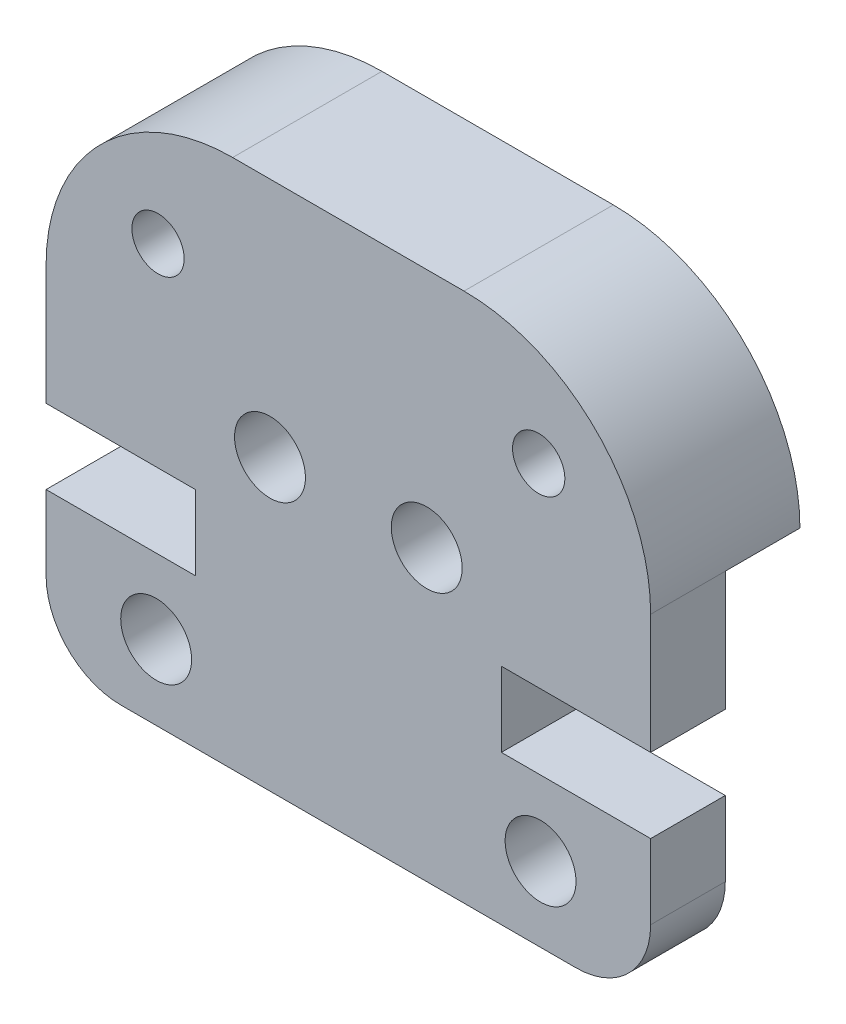
ISO-10303-21;
HEADER;
FILE_DESCRIPTION(('STEP AP214'),'2;1');
FILE_NAME('part.step','',(''),(''),'','','');
FILE_SCHEMA(('AUTOMOTIVE_DESIGN { 1 0 10303 214 1 1 1 1 }'));
ENDSEC;
DATA;
#1=APPLICATION_CONTEXT('core data for automotive mechanical design processes');
#2=APPLICATION_PROTOCOL_DEFINITION('international standard','automotive_design',2000,#1);
#3=PRODUCT_CONTEXT('',#1,'mechanical');
#4=PRODUCT('Part','Part','',(#3));
#5=PRODUCT_RELATED_PRODUCT_CATEGORY('part','',(#4));
#6=PRODUCT_DEFINITION_FORMATION('','',#4);
#7=PRODUCT_DEFINITION_CONTEXT('part definition',#1,'design');
#8=PRODUCT_DEFINITION('design','',#6,#7);
#9=PRODUCT_DEFINITION_SHAPE('','',#8);
#10=(LENGTH_UNIT() NAMED_UNIT(*) SI_UNIT(.MILLI.,.METRE.));
#11=(NAMED_UNIT(*) PLANE_ANGLE_UNIT() SI_UNIT($,.RADIAN.));
#12=(NAMED_UNIT(*) SI_UNIT($,.STERADIAN.) SOLID_ANGLE_UNIT());
#13=UNCERTAINTY_MEASURE_WITH_UNIT(LENGTH_MEASURE(1.E-05),#10,'distance_accuracy_value','');
#14=(GEOMETRIC_REPRESENTATION_CONTEXT(3) GLOBAL_UNCERTAINTY_ASSIGNED_CONTEXT((#13)) GLOBAL_UNIT_ASSIGNED_CONTEXT((#10,
#11,#12)) REPRESENTATION_CONTEXT('',''));
#15=CARTESIAN_POINT('',(0.,0.,0.));
#16=DIRECTION('',(0.,0.,1.));
#17=DIRECTION('',(1.,0.,0.));
#18=AXIS2_PLACEMENT_3D('',#15,#16,#17);
#19=CARTESIAN_POINT('',(14.2,2.00000000000002,4.));
#20=DIRECTION('',(0.,0.,-1.));
#21=DIRECTION('',(-1.,0.,0.));
#22=AXIS2_PLACEMENT_3D('',#19,#20,#21);
#23=CYLINDRICAL_SURFACE('',#22,2.00000000000001);
#24=CARTESIAN_POINT('',(14.2,2.00000000000002,2.));
#25=DIRECTION('',(0.,0.,-1.));
#26=DIRECTION('',(-1.,0.,0.));
#27=AXIS2_PLACEMENT_3D('',#24,#25,#26);
#28=CIRCLE('',#27,2.00000000000001);
#29=CARTESIAN_POINT('',(16.2,2.00000000000002,2.));
#30=VERTEX_POINT('',#29);
#31=CARTESIAN_POINT('',(14.2,0.,2.));
#32=VERTEX_POINT('',#31);
#33=EDGE_CURVE('E48',#30,#32,#28,.T.);
#34=ORIENTED_EDGE('',*,*,#33,.F.);
#35=DIRECTION('',(0.,0.,-1.));
#36=VECTOR('',#35,1.);
#37=CARTESIAN_POINT('',(16.2,2.00000000000002,4.));
#38=LINE('',#37,#36);
#39=CARTESIAN_POINT('',(16.2,2.00000000000002,4.));
#40=VERTEX_POINT('',#39);
#41=EDGE_CURVE('E11',#40,#30,#38,.T.);
#42=ORIENTED_EDGE('',*,*,#41,.F.);
#43=CARTESIAN_POINT('',(14.2,2.00000000000002,4.));
#44=DIRECTION('',(0.,0.,1.));
#45=DIRECTION('',(-1.,0.,0.));
#46=AXIS2_PLACEMENT_3D('',#43,#44,#45);
#47=CIRCLE('',#46,2.00000000000001);
#48=CARTESIAN_POINT('',(14.2,0.,4.));
#49=VERTEX_POINT('',#48);
#50=EDGE_CURVE('E159',#49,#40,#47,.T.);
#51=ORIENTED_EDGE('',*,*,#50,.F.);
#52=DIRECTION('',(0.,0.,-1.));
#53=VECTOR('',#52,1.);
#54=CARTESIAN_POINT('',(14.2,0.,4.));
#55=LINE('',#54,#53);
#56=EDGE_CURVE('E148',#49,#32,#55,.T.);
#57=ORIENTED_EDGE('',*,*,#56,.T.);
#58=EDGE_LOOP('',(#34,#42,#51,#57));
#59=FACE_BOUND('',#58,.T.);
#60=ADVANCED_FACE('F33',(#59),#23,.T.);
#61=CARTESIAN_POINT('',(16.2,2.00000000000002,4.));
#62=DIRECTION('',(-1.,0.,0.));
#63=DIRECTION('',(0.,0.,1.));
#64=AXIS2_PLACEMENT_3D('',#61,#62,#63);
#65=PLANE('',#64);
#66=DIRECTION('',(0.,-1.,0.));
#67=VECTOR('',#66,1.);
#68=CARTESIAN_POINT('',(16.2,9.205,2.));
#69=LINE('',#68,#67);
#70=CARTESIAN_POINT('',(16.2,4.00000000000002,2.));
#71=VERTEX_POINT('',#70);
#72=EDGE_CURVE('E207',#71,#30,#69,.T.);
#73=ORIENTED_EDGE('',*,*,#72,.F.);
#74=DIRECTION('',(0.,0.,-1.));
#75=VECTOR('',#74,1.);
#76=CARTESIAN_POINT('',(16.2,4.00000000000002,4.));
#77=LINE('',#76,#75);
#78=CARTESIAN_POINT('',(16.2,4.00000000000002,4.));
#79=VERTEX_POINT('',#78);
#80=EDGE_CURVE('E41',#79,#71,#77,.T.);
#81=ORIENTED_EDGE('',*,*,#80,.F.);
#82=DIRECTION('',(0.,1.,0.));
#83=VECTOR('',#82,1.);
#84=CARTESIAN_POINT('',(16.2,2.00000000000002,4.));
#85=LINE('',#84,#83);
#86=EDGE_CURVE('E81',#40,#79,#85,.T.);
#87=ORIENTED_EDGE('',*,*,#86,.F.);
#88=ORIENTED_EDGE('',*,*,#41,.T.);
#89=EDGE_LOOP('',(#73,#81,#87,#88));
#90=FACE_BOUND('',#89,.T.);
#91=ADVANCED_FACE('F206',(#90),#65,.F.);
#92=CARTESIAN_POINT('',(12.2,4.00000000000002,4.));
#93=DIRECTION('',(0.,-1.,0.));
#94=DIRECTION('',(1.,0.,0.));
#95=AXIS2_PLACEMENT_3D('',#92,#93,#94);
#96=PLANE('',#95);
#97=DIRECTION('',(1.,0.,0.));
#98=VECTOR('',#97,1.);
#99=CARTESIAN_POINT('',(12.2,4.00000000000002,2.));
#100=LINE('',#99,#98);
#101=CARTESIAN_POINT('',(12.2,4.00000000000002,2.));
#102=VERTEX_POINT('',#101);
#103=EDGE_CURVE('E200',#102,#71,#100,.T.);
#104=ORIENTED_EDGE('',*,*,#103,.F.);
#105=DIRECTION('',(0.,0.,-1.));
#106=VECTOR('',#105,1.);
#107=CARTESIAN_POINT('',(12.2,4.00000000000002,4.));
#108=LINE('',#107,#106);
#109=CARTESIAN_POINT('',(12.2,4.00000000000002,4.));
#110=VERTEX_POINT('',#109);
#111=EDGE_CURVE('E189',#110,#102,#108,.T.);
#112=ORIENTED_EDGE('',*,*,#111,.F.);
#113=DIRECTION('',(-1.,0.,0.));
#114=VECTOR('',#113,1.);
#115=CARTESIAN_POINT('',(12.2,4.00000000000002,4.));
#116=LINE('',#115,#114);
#117=EDGE_CURVE('E201',#79,#110,#116,.T.);
#118=ORIENTED_EDGE('',*,*,#117,.F.);
#119=ORIENTED_EDGE('',*,*,#80,.T.);
#120=EDGE_LOOP('',(#104,#112,#118,#119));
#121=FACE_BOUND('',#120,.T.);
#122=ADVANCED_FACE('F197',(#121),#96,.F.);
#123=CARTESIAN_POINT('',(12.2,6.00000000000003,4.));
#124=DIRECTION('',(-1.,0.,0.));
#125=DIRECTION('',(0.,-1.,0.));
#126=AXIS2_PLACEMENT_3D('',#123,#124,#125);
#127=PLANE('',#126);
#128=DIRECTION('',(0.,-1.,0.));
#129=VECTOR('',#128,1.);
#130=CARTESIAN_POINT('',(12.2,6.00000000000003,2.));
#131=LINE('',#130,#129);
#132=CARTESIAN_POINT('',(12.2,6.00000000000003,2.));
#133=VERTEX_POINT('',#132);
#134=EDGE_CURVE('E251',#133,#102,#131,.T.);
#135=ORIENTED_EDGE('',*,*,#134,.F.);
#136=DIRECTION('',(0.,0.,-1.));
#137=VECTOR('',#136,1.);
#138=CARTESIAN_POINT('',(12.2,6.00000000000003,4.));
#139=LINE('',#138,#137);
#140=CARTESIAN_POINT('',(12.2,6.00000000000003,4.));
#141=VERTEX_POINT('',#140);
#142=EDGE_CURVE('E186',#141,#133,#139,.T.);
#143=ORIENTED_EDGE('',*,*,#142,.F.);
#144=DIRECTION('',(0.,1.,0.));
#145=VECTOR('',#144,1.);
#146=CARTESIAN_POINT('',(12.2,6.00000000000003,4.));
#147=LINE('',#146,#145);
#148=EDGE_CURVE('E282',#110,#141,#147,.T.);
#149=ORIENTED_EDGE('',*,*,#148,.F.);
#150=ORIENTED_EDGE('',*,*,#111,.T.);
#151=EDGE_LOOP('',(#135,#143,#149,#150));
#152=FACE_BOUND('',#151,.T.);
#153=ADVANCED_FACE('F325',(#152),#127,.F.);
#154=CARTESIAN_POINT('',(16.2,6.00000000000003,4.));
#155=DIRECTION('',(0.,1.,0.));
#156=DIRECTION('',(-1.,0.,0.));
#157=AXIS2_PLACEMENT_3D('',#154,#155,#156);
#158=PLANE('',#157);
#159=DIRECTION('',(-1.,0.,0.));
#160=VECTOR('',#159,1.);
#161=CARTESIAN_POINT('',(16.2,6.00000000000003,2.));
#162=LINE('',#161,#160);
#163=CARTESIAN_POINT('',(16.2,6.00000000000003,2.));
#164=VERTEX_POINT('',#163);
#165=EDGE_CURVE('E248',#164,#133,#162,.T.);
#166=ORIENTED_EDGE('',*,*,#165,.F.);
#167=DIRECTION('',(0.,0.,-1.));
#168=VECTOR('',#167,1.);
#169=CARTESIAN_POINT('',(16.2,6.00000000000003,4.));
#170=LINE('',#169,#168);
#171=CARTESIAN_POINT('',(16.2,6.00000000000003,4.));
#172=VERTEX_POINT('',#171);
#173=EDGE_CURVE('E183',#172,#164,#170,.T.);
#174=ORIENTED_EDGE('',*,*,#173,.F.);
#175=DIRECTION('',(1.,0.,0.));
#176=VECTOR('',#175,1.);
#177=CARTESIAN_POINT('',(16.2,6.00000000000003,4.));
#178=LINE('',#177,#176);
#179=EDGE_CURVE('E284',#141,#172,#178,.T.);
#180=ORIENTED_EDGE('',*,*,#179,.F.);
#181=ORIENTED_EDGE('',*,*,#142,.T.);
#182=EDGE_LOOP('',(#166,#174,#180,#181));
#183=FACE_BOUND('',#182,.T.);
#184=ADVANCED_FACE('F329',(#183),#158,.F.);
#185=CARTESIAN_POINT('',(16.2,9.205,4.));
#186=DIRECTION('',(-1.,0.,0.));
#187=DIRECTION('',(0.,-1.,0.));
#188=AXIS2_PLACEMENT_3D('',#185,#186,#187);
#189=PLANE('',#188);
#190=CARTESIAN_POINT('',(16.2,9.205,2.));
#191=VERTEX_POINT('',#190);
#192=EDGE_CURVE('E209',#191,#164,#69,.T.);
#193=ORIENTED_EDGE('',*,*,#192,.F.);
#194=DIRECTION('',(0.,0.,-1.));
#195=VECTOR('',#194,1.);
#196=CARTESIAN_POINT('',(16.2,9.205,4.));
#197=LINE('',#196,#195);
#198=CARTESIAN_POINT('',(16.2,9.205,4.));
#199=VERTEX_POINT('',#198);
#200=EDGE_CURVE('E180',#199,#191,#197,.T.);
#201=ORIENTED_EDGE('',*,*,#200,.F.);
#202=DIRECTION('',(0.,1.,0.));
#203=VECTOR('',#202,1.);
#204=CARTESIAN_POINT('',(16.2,9.205,4.));
#205=LINE('',#204,#203);
#206=EDGE_CURVE('E286',#172,#199,#205,.T.);
#207=ORIENTED_EDGE('',*,*,#206,.F.);
#208=ORIENTED_EDGE('',*,*,#173,.T.);
#209=EDGE_LOOP('',(#193,#201,#207,#208));
#210=FACE_BOUND('',#209,.T.);
#211=ADVANCED_FACE('F376',(#210),#189,.F.);
#212=CARTESIAN_POINT('',(0.,9.20499999999999,4.));
#213=DIRECTION('',(1.,0.,0.));
#214=DIRECTION('',(0.,0.,-1.));
#215=AXIS2_PLACEMENT_3D('',#212,#213,#214);
#216=PLANE('',#215);
#217=DIRECTION('',(0.,1.,0.));
#218=VECTOR('',#217,1.);
#219=CARTESIAN_POINT('',(0.,0.,2.));
#220=LINE('',#219,#218);
#221=CARTESIAN_POINT('',(0.,6.00000000000003,2.));
#222=VERTEX_POINT('',#221);
#223=CARTESIAN_POINT('',(0.,9.20499999999999,2.));
#224=VERTEX_POINT('',#223);
#225=EDGE_CURVE('E349',#222,#224,#220,.T.);
#226=ORIENTED_EDGE('',*,*,#225,.F.);
#227=DIRECTION('',(0.,0.,-1.));
#228=VECTOR('',#227,1.);
#229=CARTESIAN_POINT('',(0.,6.00000000000003,4.));
#230=LINE('',#229,#228);
#231=CARTESIAN_POINT('',(0.,6.00000000000003,4.));
#232=VERTEX_POINT('',#231);
#233=EDGE_CURVE('E170',#232,#222,#230,.T.);
#234=ORIENTED_EDGE('',*,*,#233,.F.);
#235=DIRECTION('',(0.,-1.,0.));
#236=VECTOR('',#235,1.);
#237=CARTESIAN_POINT('',(0.,9.20499999999999,4.));
#238=LINE('',#237,#236);
#239=CARTESIAN_POINT('',(0.,9.20499999999999,4.));
#240=VERTEX_POINT('',#239);
#241=EDGE_CURVE('E294',#240,#232,#238,.T.);
#242=ORIENTED_EDGE('',*,*,#241,.F.);
#243=DIRECTION('',(0.,0.,-1.));
#244=VECTOR('',#243,1.);
#245=CARTESIAN_POINT('',(0.,9.20499999999999,4.));
#246=LINE('',#245,#244);
#247=EDGE_CURVE('E173',#240,#224,#246,.T.);
#248=ORIENTED_EDGE('',*,*,#247,.T.);
#249=EDGE_LOOP('',(#226,#234,#242,#248));
#250=FACE_BOUND('',#249,.T.);
#251=ADVANCED_FACE('F365',(#250),#216,.F.);
#252=CARTESIAN_POINT('',(0.,6.00000000000003,4.));
#253=DIRECTION('',(0.,1.,0.));
#254=DIRECTION('',(-1.,0.,0.));
#255=AXIS2_PLACEMENT_3D('',#252,#253,#254);
#256=PLANE('',#255);
#257=DIRECTION('',(-1.,0.,0.));
#258=VECTOR('',#257,1.);
#259=CARTESIAN_POINT('',(0.,6.00000000000003,2.));
#260=LINE('',#259,#258);
#261=CARTESIAN_POINT('',(4.00000000000001,6.00000000000003,2.));
#262=VERTEX_POINT('',#261);
#263=EDGE_CURVE('E245',#262,#222,#260,.T.);
#264=ORIENTED_EDGE('',*,*,#263,.F.);
#265=DIRECTION('',(0.,0.,-1.));
#266=VECTOR('',#265,1.);
#267=CARTESIAN_POINT('',(4.00000000000001,6.00000000000003,4.));
#268=LINE('',#267,#266);
#269=CARTESIAN_POINT('',(4.00000000000001,6.00000000000003,4.));
#270=VERTEX_POINT('',#269);
#271=EDGE_CURVE('E167',#270,#262,#268,.T.);
#272=ORIENTED_EDGE('',*,*,#271,.F.);
#273=DIRECTION('',(1.,0.,0.));
#274=VECTOR('',#273,1.);
#275=CARTESIAN_POINT('',(0.,6.00000000000003,4.));
#276=LINE('',#275,#274);
#277=EDGE_CURVE('E296',#232,#270,#276,.T.);
#278=ORIENTED_EDGE('',*,*,#277,.F.);
#279=ORIENTED_EDGE('',*,*,#233,.T.);
#280=EDGE_LOOP('',(#264,#272,#278,#279));
#281=FACE_BOUND('',#280,.T.);
#282=ADVANCED_FACE('F383',(#281),#256,.F.);
#283=CARTESIAN_POINT('',(4.00000000000001,6.00000000000003,4.));
#284=DIRECTION('',(1.,0.,0.));
#285=DIRECTION('',(0.,0.,-1.));
#286=AXIS2_PLACEMENT_3D('',#283,#284,#285);
#287=PLANE('',#286);
#288=DIRECTION('',(0.,1.,0.));
#289=VECTOR('',#288,1.);
#290=CARTESIAN_POINT('',(4.00000000000001,6.00000000000003,2.));
#291=LINE('',#290,#289);
#292=CARTESIAN_POINT('',(4.00000000000001,4.00000000000002,2.));
#293=VERTEX_POINT('',#292);
#294=EDGE_CURVE('E242',#293,#262,#291,.T.);
#295=ORIENTED_EDGE('',*,*,#294,.F.);
#296=DIRECTION('',(0.,0.,-1.));
#297=VECTOR('',#296,1.);
#298=CARTESIAN_POINT('',(4.00000000000001,4.00000000000002,4.));
#299=LINE('',#298,#297);
#300=CARTESIAN_POINT('',(4.00000000000001,4.00000000000002,4.));
#301=VERTEX_POINT('',#300);
#302=EDGE_CURVE('E164',#301,#293,#299,.T.);
#303=ORIENTED_EDGE('',*,*,#302,.F.);
#304=DIRECTION('',(0.,-1.,0.));
#305=VECTOR('',#304,1.);
#306=CARTESIAN_POINT('',(4.00000000000001,6.00000000000003,4.));
#307=LINE('',#306,#305);
#308=EDGE_CURVE('E298',#270,#301,#307,.T.);
#309=ORIENTED_EDGE('',*,*,#308,.F.);
#310=ORIENTED_EDGE('',*,*,#271,.T.);
#311=EDGE_LOOP('',(#295,#303,#309,#310));
#312=FACE_BOUND('',#311,.T.);
#313=ADVANCED_FACE('F305',(#312),#287,.F.);
#314=CARTESIAN_POINT('',(4.00000000000001,4.00000000000002,4.));
#315=DIRECTION('',(0.,-1.,0.));
#316=DIRECTION('',(1.,0.,0.));
#317=AXIS2_PLACEMENT_3D('',#314,#315,#316);
#318=PLANE('',#317);
#319=DIRECTION('',(1.,0.,0.));
#320=VECTOR('',#319,1.);
#321=CARTESIAN_POINT('',(4.00000000000001,4.00000000000002,2.));
#322=LINE('',#321,#320);
#323=CARTESIAN_POINT('',(0.,4.00000000000003,2.));
#324=VERTEX_POINT('',#323);
#325=EDGE_CURVE('E239',#324,#293,#322,.T.);
#326=ORIENTED_EDGE('',*,*,#325,.F.);
#327=DIRECTION('',(0.,0.,-1.));
#328=VECTOR('',#327,1.);
#329=CARTESIAN_POINT('',(0.,4.00000000000003,4.));
#330=LINE('',#329,#328);
#331=CARTESIAN_POINT('',(0.,4.00000000000003,4.));
#332=VERTEX_POINT('',#331);
#333=EDGE_CURVE('E142',#332,#324,#330,.T.);
#334=ORIENTED_EDGE('',*,*,#333,.F.);
#335=DIRECTION('',(-1.,0.,0.));
#336=VECTOR('',#335,1.);
#337=CARTESIAN_POINT('',(4.00000000000001,4.00000000000002,4.));
#338=LINE('',#337,#336);
#339=EDGE_CURVE('E128',#301,#332,#338,.T.);
#340=ORIENTED_EDGE('',*,*,#339,.F.);
#341=ORIENTED_EDGE('',*,*,#302,.T.);
#342=EDGE_LOOP('',(#326,#334,#340,#341));
#343=FACE_BOUND('',#342,.T.);
#344=ADVANCED_FACE('F309',(#343),#318,.F.);
#345=CARTESIAN_POINT('',(0.,2.00000000000001,4.));
#346=DIRECTION('',(1.,0.,0.));
#347=DIRECTION('',(0.,0.,-1.));
#348=AXIS2_PLACEMENT_3D('',#345,#346,#347);
#349=PLANE('',#348);
#350=CARTESIAN_POINT('',(0.,2.00000000000001,2.));
#351=VERTEX_POINT('',#350);
#352=EDGE_CURVE('E139',#351,#324,#220,.T.);
#353=ORIENTED_EDGE('',*,*,#352,.F.);
#354=DIRECTION('',(0.,0.,-1.));
#355=VECTOR('',#354,1.);
#356=CARTESIAN_POINT('',(0.,2.00000000000001,4.));
#357=LINE('',#356,#355);
#358=CARTESIAN_POINT('',(0.,2.00000000000001,4.));
#359=VERTEX_POINT('',#358);
#360=EDGE_CURVE('E135',#359,#351,#357,.T.);
#361=ORIENTED_EDGE('',*,*,#360,.F.);
#362=DIRECTION('',(0.,-1.,0.));
#363=VECTOR('',#362,1.);
#364=CARTESIAN_POINT('',(0.,2.00000000000001,4.));
#365=LINE('',#364,#363);
#366=EDGE_CURVE('E120',#332,#359,#365,.T.);
#367=ORIENTED_EDGE('',*,*,#366,.F.);
#368=ORIENTED_EDGE('',*,*,#333,.T.);
#369=EDGE_LOOP('',(#353,#361,#367,#368));
#370=FACE_BOUND('',#369,.T.);
#371=ADVANCED_FACE('F136',(#370),#349,.F.);
#372=CARTESIAN_POINT('',(2.,2.00000000000001,4.));
#373=DIRECTION('',(0.,0.,-1.));
#374=DIRECTION('',(-1.,0.,0.));
#375=AXIS2_PLACEMENT_3D('',#372,#373,#374);
#376=CYLINDRICAL_SURFACE('',#375,2.00000000000001);
#377=CARTESIAN_POINT('',(2.,2.00000000000001,2.));
#378=DIRECTION('',(0.,0.,-1.));
#379=DIRECTION('',(-1.,0.,0.));
#380=AXIS2_PLACEMENT_3D('',#377,#378,#379);
#381=CIRCLE('',#380,2.00000000000001);
#382=CARTESIAN_POINT('',(2.,0.,2.));
#383=VERTEX_POINT('',#382);
#384=EDGE_CURVE('E236',#383,#351,#381,.T.);
#385=ORIENTED_EDGE('',*,*,#384,.F.);
#386=DIRECTION('',(0.,0.,-1.));
#387=VECTOR('',#386,1.);
#388=CARTESIAN_POINT('',(2.,0.,4.));
#389=LINE('',#388,#387);
#390=CARTESIAN_POINT('',(2.,0.,4.));
#391=VERTEX_POINT('',#390);
#392=EDGE_CURVE('E143',#391,#383,#389,.T.);
#393=ORIENTED_EDGE('',*,*,#392,.F.);
#394=CARTESIAN_POINT('',(2.,2.00000000000001,4.));
#395=DIRECTION('',(0.,0.,1.));
#396=DIRECTION('',(1.,0.,0.));
#397=AXIS2_PLACEMENT_3D('',#394,#395,#396);
#398=CIRCLE('',#397,2.00000000000001);
#399=EDGE_CURVE('E125',#359,#391,#398,.T.);
#400=ORIENTED_EDGE('',*,*,#399,.F.);
#401=ORIENTED_EDGE('',*,*,#360,.T.);
#402=EDGE_LOOP('',(#385,#393,#400,#401));
#403=FACE_BOUND('',#402,.T.);
#404=ADVANCED_FACE('F145',(#403),#376,.T.);
#405=CARTESIAN_POINT('',(2.,0.,4.));
#406=DIRECTION('',(0.,1.,0.));
#407=DIRECTION('',(-1.,0.,0.));
#408=AXIS2_PLACEMENT_3D('',#405,#406,#407);
#409=PLANE('',#408);
#410=DIRECTION('',(-1.,0.,0.));
#411=VECTOR('',#410,1.);
#412=CARTESIAN_POINT('',(16.2,0.,2.));
#413=LINE('',#412,#411);
#414=EDGE_CURVE('E221',#32,#383,#413,.T.);
#415=ORIENTED_EDGE('',*,*,#414,.F.);
#416=ORIENTED_EDGE('',*,*,#56,.F.);
#417=DIRECTION('',(1.,0.,0.));
#418=VECTOR('',#417,1.);
#419=CARTESIAN_POINT('',(2.,0.,4.));
#420=LINE('',#419,#418);
#421=EDGE_CURVE('E57',#391,#49,#420,.T.);
#422=ORIENTED_EDGE('',*,*,#421,.F.);
#423=ORIENTED_EDGE('',*,*,#392,.T.);
#424=EDGE_LOOP('',(#415,#416,#422,#423));
#425=FACE_BOUND('',#424,.T.);
#426=ADVANCED_FACE('F457',(#425),#409,.F.);
#427=CARTESIAN_POINT('',(13.25,2.00000000000002,4.));
#428=DIRECTION('',(0.,0.,-1.));
#429=DIRECTION('',(-1.,0.,0.));
#430=AXIS2_PLACEMENT_3D('',#427,#428,#429);
#431=CYLINDRICAL_SURFACE('',#430,0.949999999999999);
#432=CARTESIAN_POINT('',(13.25,2.00000000000002,4.));
#433=DIRECTION('',(0.,0.,1.));
#434=DIRECTION('',(-1.,0.,0.));
#435=AXIS2_PLACEMENT_3D('',#432,#433,#434);
#436=CIRCLE('',#435,0.949999999999999);
#437=CARTESIAN_POINT('',(12.3,2.00000000000002,4.));
#438=VERTEX_POINT('',#437);
#439=EDGE_CURVE('E154',#438,#438,#436,.T.);
#440=ORIENTED_EDGE('',*,*,#439,.T.);
#441=EDGE_LOOP('',(#440));
#442=FACE_BOUND('',#441,.T.);
#443=CARTESIAN_POINT('',(13.25,2.00000000000002,2.));
#444=DIRECTION('',(0.,0.,-1.));
#445=DIRECTION('',(-1.,0.,0.));
#446=AXIS2_PLACEMENT_3D('',#443,#444,#445);
#447=CIRCLE('',#446,0.949999999999999);
#448=CARTESIAN_POINT('',(12.3,2.00000000000002,2.));
#449=VERTEX_POINT('',#448);
#450=EDGE_CURVE('E233',#449,#449,#447,.T.);
#451=ORIENTED_EDGE('',*,*,#450,.T.);
#452=EDGE_LOOP('',(#451));
#453=FACE_BOUND('',#452,.T.);
#454=ADVANCED_FACE('F466',(#442,#453),#431,.F.);
#455=CARTESIAN_POINT('',(10.2000000000053,7.75,4.));
#456=DIRECTION('',(0.,0.,-1.));
#457=DIRECTION('',(-1.,0.,0.));
#458=AXIS2_PLACEMENT_3D('',#455,#456,#457);
#459=CYLINDRICAL_SURFACE('',#458,0.949999999999999);
#460=CARTESIAN_POINT('',(10.2000000000053,7.75,4.));
#461=DIRECTION('',(0.,0.,1.));
#462=DIRECTION('',(-1.,0.,0.));
#463=AXIS2_PLACEMENT_3D('',#460,#461,#462);
#464=CIRCLE('',#463,0.949999999999999);
#465=CARTESIAN_POINT('',(9.25000000000532,7.75,4.));
#466=VERTEX_POINT('',#465);
#467=EDGE_CURVE('E268',#466,#466,#464,.T.);
#468=ORIENTED_EDGE('',*,*,#467,.T.);
#469=EDGE_LOOP('',(#468));
#470=FACE_BOUND('',#469,.T.);
#471=CARTESIAN_POINT('',(10.2000000000053,7.75,2.));
#472=DIRECTION('',(0.,0.,-1.));
#473=DIRECTION('',(-1.,0.,0.));
#474=AXIS2_PLACEMENT_3D('',#471,#472,#473);
#475=CIRCLE('',#474,0.949999999999999);
#476=CARTESIAN_POINT('',(9.25000000000532,7.75,2.));
#477=VERTEX_POINT('',#476);
#478=EDGE_CURVE('E230',#477,#477,#475,.T.);
#479=ORIENTED_EDGE('',*,*,#478,.T.);
#480=EDGE_LOOP('',(#479));
#481=FACE_BOUND('',#480,.T.);
#482=ADVANCED_FACE('F476',(#470,#481),#459,.F.);
#483=CARTESIAN_POINT('',(5.99999999999468,7.75,4.));
#484=DIRECTION('',(0.,0.,-1.));
#485=DIRECTION('',(-1.,0.,0.));
#486=AXIS2_PLACEMENT_3D('',#483,#484,#485);
#487=CYLINDRICAL_SURFACE('',#486,0.95);
#488=CARTESIAN_POINT('',(5.99999999999468,7.75,4.));
#489=DIRECTION('',(0.,0.,1.));
#490=DIRECTION('',(1.,0.,0.));
#491=AXIS2_PLACEMENT_3D('',#488,#489,#490);
#492=CIRCLE('',#491,0.95);
#493=CARTESIAN_POINT('',(6.94999999999468,7.75,4.));
#494=VERTEX_POINT('',#493);
#495=EDGE_CURVE('E263',#494,#494,#492,.T.);
#496=ORIENTED_EDGE('',*,*,#495,.T.);
#497=EDGE_LOOP('',(#496));
#498=FACE_BOUND('',#497,.T.);
#499=CARTESIAN_POINT('',(5.99999999999468,7.75,2.));
#500=DIRECTION('',(0.,0.,-1.));
#501=DIRECTION('',(-1.,0.,0.));
#502=AXIS2_PLACEMENT_3D('',#499,#500,#501);
#503=CIRCLE('',#502,0.95);
#504=CARTESIAN_POINT('',(5.04999999999468,7.75,2.));
#505=VERTEX_POINT('',#504);
#506=EDGE_CURVE('E227',#505,#505,#503,.T.);
#507=ORIENTED_EDGE('',*,*,#506,.T.);
#508=EDGE_LOOP('',(#507));
#509=FACE_BOUND('',#508,.T.);
#510=ADVANCED_FACE('F486',(#498,#509),#487,.F.);
#511=CARTESIAN_POINT('',(2.95,2.00000000000002,4.));
#512=DIRECTION('',(0.,0.,-1.));
#513=DIRECTION('',(-1.,0.,0.));
#514=AXIS2_PLACEMENT_3D('',#511,#512,#513);
#515=CYLINDRICAL_SURFACE('',#514,0.95);
#516=CARTESIAN_POINT('',(2.95,2.00000000000002,4.));
#517=DIRECTION('',(0.,0.,1.));
#518=DIRECTION('',(1.,0.,0.));
#519=AXIS2_PLACEMENT_3D('',#516,#517,#518);
#520=CIRCLE('',#519,0.95);
#521=CARTESIAN_POINT('',(3.9,2.00000000000002,4.));
#522=VERTEX_POINT('',#521);
#523=EDGE_CURVE('E256',#522,#522,#520,.T.);
#524=ORIENTED_EDGE('',*,*,#523,.T.);
#525=EDGE_LOOP('',(#524));
#526=FACE_BOUND('',#525,.T.);
#527=CARTESIAN_POINT('',(2.95,2.00000000000002,2.));
#528=DIRECTION('',(0.,0.,-1.));
#529=DIRECTION('',(-1.,0.,0.));
#530=AXIS2_PLACEMENT_3D('',#527,#528,#529);
#531=CIRCLE('',#530,0.95);
#532=CARTESIAN_POINT('',(2.,2.00000000000002,2.));
#533=VERTEX_POINT('',#532);
#534=EDGE_CURVE('E36',#533,#533,#531,.T.);
#535=ORIENTED_EDGE('',*,*,#534,.T.);
#536=EDGE_LOOP('',(#535));
#537=FACE_BOUND('',#536,.T.);
#538=ADVANCED_FACE('F496',(#526,#537),#515,.F.);
#539=CARTESIAN_POINT('',(14.2,2.00000000000002,4.));
#540=DIRECTION('',(0.,0.,-1.));
#541=DIRECTION('',(-1.,0.,0.));
#542=AXIS2_PLACEMENT_3D('',#539,#540,#541);
#543=PLANE('',#542);
#544=CARTESIAN_POINT('',(3.00000000000434,11.2049999999999,4.));
#545=DIRECTION('',(0.,0.,1.));
#546=DIRECTION('',(1.,0.,0.));
#547=AXIS2_PLACEMENT_3D('',#544,#545,#546);
#548=CIRCLE('',#547,0.699999999999998);
#549=CARTESIAN_POINT('',(3.70000000000434,11.2049999999999,4.));
#550=VERTEX_POINT('',#549);
#551=EDGE_CURVE('E260',#550,#550,#548,.T.);
#552=ORIENTED_EDGE('',*,*,#551,.F.);
#553=EDGE_LOOP('',(#552));
#554=FACE_BOUND('',#553,.T.);
#555=ORIENTED_EDGE('',*,*,#467,.F.);
#556=EDGE_LOOP('',(#555));
#557=FACE_BOUND('',#556,.T.);
#558=ORIENTED_EDGE('',*,*,#439,.F.);
#559=EDGE_LOOP('',(#558));
#560=FACE_BOUND('',#559,.T.);
#561=ORIENTED_EDGE('',*,*,#50,.T.);
#562=ORIENTED_EDGE('',*,*,#86,.T.);
#563=ORIENTED_EDGE('',*,*,#117,.T.);
#564=ORIENTED_EDGE('',*,*,#148,.T.);
#565=ORIENTED_EDGE('',*,*,#179,.T.);
#566=ORIENTED_EDGE('',*,*,#206,.T.);
#567=CARTESIAN_POINT('',(11.2,9.20499999999999,4.));
#568=DIRECTION('',(0.,0.,1.));
#569=DIRECTION('',(-1.,0.,0.));
#570=AXIS2_PLACEMENT_3D('',#567,#568,#569);
#571=CIRCLE('',#570,5.);
#572=CARTESIAN_POINT('',(11.2,14.205,4.));
#573=VERTEX_POINT('',#572);
#574=EDGE_CURVE('E288',#199,#573,#571,.T.);
#575=ORIENTED_EDGE('',*,*,#574,.T.);
#576=DIRECTION('',(-1.,0.,0.));
#577=VECTOR('',#576,1.);
#578=CARTESIAN_POINT('',(5.,14.205,4.));
#579=LINE('',#578,#577);
#580=CARTESIAN_POINT('',(5.,14.205,4.));
#581=VERTEX_POINT('',#580);
#582=EDGE_CURVE('E290',#573,#581,#579,.T.);
#583=ORIENTED_EDGE('',*,*,#582,.T.);
#584=CARTESIAN_POINT('',(5.,9.20499999999999,4.));
#585=DIRECTION('',(0.,0.,1.));
#586=DIRECTION('',(1.,0.,0.));
#587=AXIS2_PLACEMENT_3D('',#584,#585,#586);
#588=CIRCLE('',#587,5.);
#589=EDGE_CURVE('E292',#581,#240,#588,.T.);
#590=ORIENTED_EDGE('',*,*,#589,.T.);
#591=ORIENTED_EDGE('',*,*,#241,.T.);
#592=ORIENTED_EDGE('',*,*,#277,.T.);
#593=ORIENTED_EDGE('',*,*,#308,.T.);
#594=ORIENTED_EDGE('',*,*,#339,.T.);
#595=ORIENTED_EDGE('',*,*,#366,.T.);
#596=ORIENTED_EDGE('',*,*,#399,.T.);
#597=ORIENTED_EDGE('',*,*,#421,.T.);
#598=EDGE_LOOP('',(#561,#562,#563,#564,#565,#566,#575,#583,#590,#591,#592,#593,#594,#595,#596,#597));
#599=FACE_BOUND('',#598,.T.);
#600=CARTESIAN_POINT('',(13.1999999999957,11.2049999999999,4.));
#601=DIRECTION('',(0.,0.,1.));
#602=DIRECTION('',(-1.,0.,0.));
#603=AXIS2_PLACEMENT_3D('',#600,#601,#602);
#604=CIRCLE('',#603,0.699999999999999);
#605=CARTESIAN_POINT('',(12.4999999999957,11.2049999999999,4.));
#606=VERTEX_POINT('',#605);
#607=EDGE_CURVE('E272',#606,#606,#604,.T.);
#608=ORIENTED_EDGE('',*,*,#607,.F.);
#609=EDGE_LOOP('',(#608));
#610=FACE_BOUND('',#609,.T.);
#611=ORIENTED_EDGE('',*,*,#495,.F.);
#612=EDGE_LOOP('',(#611));
#613=FACE_BOUND('',#612,.T.);
#614=ORIENTED_EDGE('',*,*,#523,.F.);
#615=EDGE_LOOP('',(#614));
#616=FACE_BOUND('',#615,.T.);
#617=ADVANCED_FACE('F122',(#554,#557,#560,#599,#610,#613,#616),#543,.F.);
#618=CARTESIAN_POINT('',(14.2,2.00000000000002,0.));
#619=DIRECTION('',(0.,0.,-1.));
#620=DIRECTION('',(-1.,0.,0.));
#621=AXIS2_PLACEMENT_3D('',#618,#619,#620);
#622=PLANE('',#621);
#623=DIRECTION('',(1.,0.,0.));
#624=VECTOR('',#623,1.);
#625=CARTESIAN_POINT('',(0.,9.20499999999999,0.));
#626=LINE('',#625,#624);
#627=CARTESIAN_POINT('',(0.,9.20499999999999,0.));
#628=VERTEX_POINT('',#627);
#629=CARTESIAN_POINT('',(16.2,9.205,0.));
#630=VERTEX_POINT('',#629);
#631=EDGE_CURVE('E218',#628,#630,#626,.T.);
#632=ORIENTED_EDGE('',*,*,#631,.F.);
#633=CARTESIAN_POINT('',(5.,9.20499999999999,0.));
#634=DIRECTION('',(0.,0.,1.));
#635=DIRECTION('',(1.,0.,0.));
#636=AXIS2_PLACEMENT_3D('',#633,#634,#635);
#637=CIRCLE('',#636,5.);
#638=CARTESIAN_POINT('',(5.,14.205,0.));
#639=VERTEX_POINT('',#638);
#640=EDGE_CURVE('E156',#639,#628,#637,.T.);
#641=ORIENTED_EDGE('',*,*,#640,.F.);
#642=DIRECTION('',(-1.,0.,0.));
#643=VECTOR('',#642,1.);
#644=CARTESIAN_POINT('',(5.,14.205,0.));
#645=LINE('',#644,#643);
#646=CARTESIAN_POINT('',(11.2,14.205,0.));
#647=VERTEX_POINT('',#646);
#648=EDGE_CURVE('E73',#647,#639,#645,.T.);
#649=ORIENTED_EDGE('',*,*,#648,.F.);
#650=CARTESIAN_POINT('',(11.2,9.20499999999999,0.));
#651=DIRECTION('',(0.,0.,1.));
#652=DIRECTION('',(-1.,0.,0.));
#653=AXIS2_PLACEMENT_3D('',#650,#651,#652);
#654=CIRCLE('',#653,5.);
#655=EDGE_CURVE('E152',#630,#647,#654,.T.);
#656=ORIENTED_EDGE('',*,*,#655,.F.);
#657=EDGE_LOOP('',(#632,#641,#649,#656));
#658=FACE_BOUND('',#657,.T.);
#659=CARTESIAN_POINT('',(3.00000000000434,11.2049999999999,0.));
#660=DIRECTION('',(0.,0.,1.));
#661=DIRECTION('',(1.,0.,0.));
#662=AXIS2_PLACEMENT_3D('',#659,#660,#661);
#663=CIRCLE('',#662,0.699999999999998);
#664=CARTESIAN_POINT('',(3.70000000000434,11.2049999999999,0.));
#665=VERTEX_POINT('',#664);
#666=EDGE_CURVE('E259',#665,#665,#663,.T.);
#667=ORIENTED_EDGE('',*,*,#666,.T.);
#668=EDGE_LOOP('',(#667));
#669=FACE_BOUND('',#668,.T.);
#670=CARTESIAN_POINT('',(13.1999999999957,11.2049999999999,0.));
#671=DIRECTION('',(0.,0.,1.));
#672=DIRECTION('',(-1.,0.,0.));
#673=AXIS2_PLACEMENT_3D('',#670,#671,#672);
#674=CIRCLE('',#673,0.699999999999999);
#675=CARTESIAN_POINT('',(12.4999999999957,11.2049999999999,0.));
#676=VERTEX_POINT('',#675);
#677=EDGE_CURVE('E271',#676,#676,#674,.T.);
#678=ORIENTED_EDGE('',*,*,#677,.T.);
#679=EDGE_LOOP('',(#678));
#680=FACE_BOUND('',#679,.T.);
#681=ADVANCED_FACE('F368',(#658,#669,#680),#622,.T.);
#682=CARTESIAN_POINT('',(11.2,9.20499999999999,4.));
#683=DIRECTION('',(0.,0.,-1.));
#684=DIRECTION('',(-1.,0.,0.));
#685=AXIS2_PLACEMENT_3D('',#682,#683,#684);
#686=CYLINDRICAL_SURFACE('',#685,5.);
#687=ORIENTED_EDGE('',*,*,#655,.T.);
#688=DIRECTION('',(0.,0.,-1.));
#689=VECTOR('',#688,1.);
#690=CARTESIAN_POINT('',(11.2,14.205,4.));
#691=LINE('',#690,#689);
#692=EDGE_CURVE('E178',#573,#647,#691,.T.);
#693=ORIENTED_EDGE('',*,*,#692,.F.);
#694=ORIENTED_EDGE('',*,*,#574,.F.);
#695=ORIENTED_EDGE('',*,*,#200,.T.);
#696=DIRECTION('',(0.,0.,-1.));
#697=VECTOR('',#696,1.);
#698=CARTESIAN_POINT('',(16.2,9.205,2.));
#699=LINE('',#698,#697);
#700=EDGE_CURVE('E222',#191,#630,#699,.T.);
#701=ORIENTED_EDGE('',*,*,#700,.T.);
#702=EDGE_LOOP('',(#687,#693,#694,#695,#701));
#703=FACE_BOUND('',#702,.T.);
#704=ADVANCED_FACE('F372',(#703),#686,.T.);
#705=CARTESIAN_POINT('',(5.,14.205,4.));
#706=DIRECTION('',(0.,-1.,0.));
#707=DIRECTION('',(0.,0.,-1.));
#708=AXIS2_PLACEMENT_3D('',#705,#706,#707);
#709=PLANE('',#708);
#710=ORIENTED_EDGE('',*,*,#648,.T.);
#711=DIRECTION('',(0.,0.,-1.));
#712=VECTOR('',#711,1.);
#713=CARTESIAN_POINT('',(5.,14.205,4.));
#714=LINE('',#713,#712);
#715=EDGE_CURVE('E176',#581,#639,#714,.T.);
#716=ORIENTED_EDGE('',*,*,#715,.F.);
#717=ORIENTED_EDGE('',*,*,#582,.F.);
#718=ORIENTED_EDGE('',*,*,#692,.T.);
#719=EDGE_LOOP('',(#710,#716,#717,#718));
#720=FACE_BOUND('',#719,.T.);
#721=ADVANCED_FACE('F526',(#720),#709,.F.);
#722=CARTESIAN_POINT('',(5.,9.20499999999999,4.));
#723=DIRECTION('',(0.,0.,-1.));
#724=DIRECTION('',(-1.,0.,0.));
#725=AXIS2_PLACEMENT_3D('',#722,#723,#724);
#726=CYLINDRICAL_SURFACE('',#725,5.);
#727=ORIENTED_EDGE('',*,*,#640,.T.);
#728=DIRECTION('',(0.,0.,-1.));
#729=VECTOR('',#728,1.);
#730=CARTESIAN_POINT('',(0.,9.20499999999999,2.));
#731=LINE('',#730,#729);
#732=EDGE_CURVE('E213',#224,#628,#731,.T.);
#733=ORIENTED_EDGE('',*,*,#732,.F.);
#734=ORIENTED_EDGE('',*,*,#247,.F.);
#735=ORIENTED_EDGE('',*,*,#589,.F.);
#736=ORIENTED_EDGE('',*,*,#715,.T.);
#737=EDGE_LOOP('',(#727,#733,#734,#735,#736));
#738=FACE_BOUND('',#737,.T.);
#739=ADVANCED_FACE('F361',(#738),#726,.T.);
#740=CARTESIAN_POINT('',(13.1999999999957,11.2049999999999,4.));
#741=DIRECTION('',(0.,0.,-1.));
#742=DIRECTION('',(-1.,0.,0.));
#743=AXIS2_PLACEMENT_3D('',#740,#741,#742);
#744=CYLINDRICAL_SURFACE('',#743,0.699999999999999);
#745=ORIENTED_EDGE('',*,*,#607,.T.);
#746=EDGE_LOOP('',(#745));
#747=FACE_BOUND('',#746,.T.);
#748=ORIENTED_EDGE('',*,*,#677,.F.);
#749=EDGE_LOOP('',(#748));
#750=FACE_BOUND('',#749,.T.);
#751=ADVANCED_FACE('F536',(#747,#750),#744,.F.);
#752=CARTESIAN_POINT('',(3.00000000000434,11.2049999999999,4.));
#753=DIRECTION('',(0.,0.,-1.));
#754=DIRECTION('',(-1.,0.,0.));
#755=AXIS2_PLACEMENT_3D('',#752,#753,#754);
#756=CYLINDRICAL_SURFACE('',#755,0.699999999999998);
#757=ORIENTED_EDGE('',*,*,#551,.T.);
#758=EDGE_LOOP('',(#757));
#759=FACE_BOUND('',#758,.T.);
#760=ORIENTED_EDGE('',*,*,#666,.F.);
#761=EDGE_LOOP('',(#760));
#762=FACE_BOUND('',#761,.T.);
#763=ADVANCED_FACE('F547',(#759,#762),#756,.F.);
#764=CARTESIAN_POINT('',(0.,0.,2.));
#765=DIRECTION('',(0.,0.,-1.));
#766=DIRECTION('',(-1.,0.,0.));
#767=AXIS2_PLACEMENT_3D('',#764,#765,#766);
#768=PLANE('',#767);
#769=ORIENTED_EDGE('',*,*,#450,.F.);
#770=EDGE_LOOP('',(#769));
#771=FACE_BOUND('',#770,.T.);
#772=ORIENTED_EDGE('',*,*,#478,.F.);
#773=EDGE_LOOP('',(#772));
#774=FACE_BOUND('',#773,.T.);
#775=ORIENTED_EDGE('',*,*,#506,.F.);
#776=EDGE_LOOP('',(#775));
#777=FACE_BOUND('',#776,.T.);
#778=ORIENTED_EDGE('',*,*,#534,.F.);
#779=EDGE_LOOP('',(#778));
#780=FACE_BOUND('',#779,.T.);
#781=ORIENTED_EDGE('',*,*,#33,.T.);
#782=ORIENTED_EDGE('',*,*,#414,.T.);
#783=ORIENTED_EDGE('',*,*,#384,.T.);
#784=ORIENTED_EDGE('',*,*,#352,.T.);
#785=ORIENTED_EDGE('',*,*,#325,.T.);
#786=ORIENTED_EDGE('',*,*,#294,.T.);
#787=ORIENTED_EDGE('',*,*,#263,.T.);
#788=ORIENTED_EDGE('',*,*,#225,.T.);
#789=DIRECTION('',(1.,0.,0.));
#790=VECTOR('',#789,1.);
#791=CARTESIAN_POINT('',(0.,9.20499999999999,2.));
#792=LINE('',#791,#790);
#793=EDGE_CURVE('E210',#224,#191,#792,.T.);
#794=ORIENTED_EDGE('',*,*,#793,.T.);
#795=ORIENTED_EDGE('',*,*,#192,.T.);
#796=ORIENTED_EDGE('',*,*,#165,.T.);
#797=ORIENTED_EDGE('',*,*,#134,.T.);
#798=ORIENTED_EDGE('',*,*,#103,.T.);
#799=ORIENTED_EDGE('',*,*,#72,.T.);
#800=EDGE_LOOP('',(#781,#782,#783,#784,#785,#786,#787,#788,#794,#795,#796,#797,#798,#799));
#801=FACE_BOUND('',#800,.T.);
#802=ADVANCED_FACE('F322',(#771,#774,#777,#780,#801),#768,.T.);
#803=CARTESIAN_POINT('',(0.,9.20499999999999,2.));
#804=DIRECTION('',(0.,1.,0.));
#805=DIRECTION('',(-1.,0.,0.));
#806=AXIS2_PLACEMENT_3D('',#803,#804,#805);
#807=PLANE('',#806);
#808=ORIENTED_EDGE('',*,*,#631,.T.);
#809=ORIENTED_EDGE('',*,*,#700,.F.);
#810=ORIENTED_EDGE('',*,*,#793,.F.);
#811=ORIENTED_EDGE('',*,*,#732,.T.);
#812=EDGE_LOOP('',(#808,#809,#810,#811));
#813=FACE_BOUND('',#812,.T.);
#814=ADVANCED_FACE('F357',(#813),#807,.F.);
#815=CLOSED_SHELL('',(#60,#91,#122,#153,#184,#211,#251,#282,#313,#344,#371,#404,#426,#454,#482,
#510,#538,#617,#681,#704,#721,#739,#751,#763,#802,#814));
#816=MANIFOLD_SOLID_BREP('B2',#815);
#817=ADVANCED_BREP_SHAPE_REPRESENTATION('',(#18,#816),#14);
#818=SHAPE_DEFINITION_REPRESENTATION(#9,#817);
ENDSEC;
END-ISO-10303-21;
